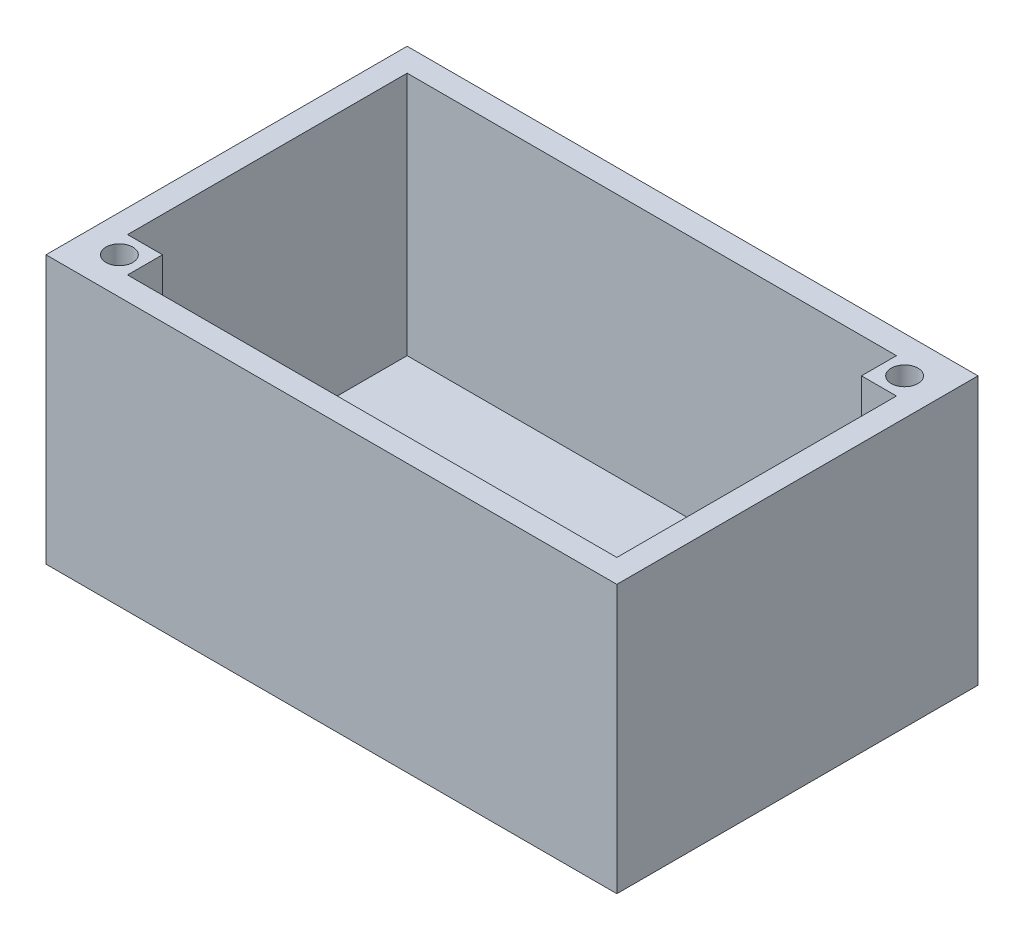
ISO-10303-21;
HEADER;
FILE_DESCRIPTION(('STEP AP214'),'2;1');
FILE_NAME('part.step','',(''),(''),'','','');
FILE_SCHEMA(('AUTOMOTIVE_DESIGN { 1 0 10303 214 1 1 1 1 }'));
ENDSEC;
DATA;
#1=APPLICATION_CONTEXT('core data for automotive mechanical design processes');
#2=APPLICATION_PROTOCOL_DEFINITION('international standard','automotive_design',2000,#1);
#3=PRODUCT_CONTEXT('',#1,'mechanical');
#4=PRODUCT('Part','Part','',(#3));
#5=PRODUCT_RELATED_PRODUCT_CATEGORY('part','',(#4));
#6=PRODUCT_DEFINITION_FORMATION('','',#4);
#7=PRODUCT_DEFINITION_CONTEXT('part definition',#1,'design');
#8=PRODUCT_DEFINITION('design','',#6,#7);
#9=PRODUCT_DEFINITION_SHAPE('','',#8);
#10=(LENGTH_UNIT() NAMED_UNIT(*) SI_UNIT(.MILLI.,.METRE.));
#11=(NAMED_UNIT(*) PLANE_ANGLE_UNIT() SI_UNIT($,.RADIAN.));
#12=(NAMED_UNIT(*) SI_UNIT($,.STERADIAN.) SOLID_ANGLE_UNIT());
#13=UNCERTAINTY_MEASURE_WITH_UNIT(LENGTH_MEASURE(1.E-05),#10,'distance_accuracy_value','');
#14=(GEOMETRIC_REPRESENTATION_CONTEXT(3) GLOBAL_UNCERTAINTY_ASSIGNED_CONTEXT((#13)) GLOBAL_UNIT_ASSIGNED_CONTEXT((#10,
#11,#12)) REPRESENTATION_CONTEXT('',''));
#15=CARTESIAN_POINT('',(0.,0.,0.));
#16=DIRECTION('',(0.,0.,1.));
#17=DIRECTION('',(1.,0.,0.));
#18=AXIS2_PLACEMENT_3D('',#15,#16,#17);
#19=CARTESIAN_POINT('',(0.,2.54,-39.37));
#20=DIRECTION('',(0.,-1.,0.));
#21=DIRECTION('',(0.,0.,-1.));
#22=AXIS2_PLACEMENT_3D('',#19,#20,#21);
#23=PLANE('',#22);
#24=CARTESIAN_POINT('',(4.0005,2.54,-4.0005));
#25=DIRECTION('',(0.,-1.,0.));
#26=DIRECTION('',(0.,0.,-1.));
#27=AXIS2_PLACEMENT_3D('',#24,#25,#26);
#28=CIRCLE('',#27,1.4605);
#29=CARTESIAN_POINT('',(4.0005,2.54,-5.461));
#30=VERTEX_POINT('',#29);
#31=EDGE_CURVE('E222',#30,#30,#28,.F.);
#32=ORIENTED_EDGE('',*,*,#31,.T.);
#33=EDGE_LOOP('',(#32));
#34=FACE_BOUND('',#33,.T.);
#35=ADVANCED_FACE('F85',(#34),#23,.F.);
#36=CARTESIAN_POINT('',(58.2295,2.54,-35.3695));
#37=DIRECTION('',(0.,-1.,0.));
#38=DIRECTION('',(0.,0.,-1.));
#39=AXIS2_PLACEMENT_3D('',#36,#37,#38);
#40=CIRCLE('',#39,1.46049999999999);
#41=CARTESIAN_POINT('',(58.2295,2.54,-36.83));
#42=VERTEX_POINT('',#41);
#43=EDGE_CURVE('E211',#42,#42,#40,.F.);
#44=ORIENTED_EDGE('',*,*,#43,.T.);
#45=EDGE_LOOP('',(#44));
#46=FACE_BOUND('',#45,.T.);
#47=ADVANCED_FACE('F304',(#46),#23,.F.);
#48=DIRECTION('',(0.,0.,1.));
#49=VECTOR('',#48,1.);
#50=CARTESIAN_POINT('',(2.54,2.54,-39.37));
#51=LINE('',#50,#49);
#52=CARTESIAN_POINT('',(2.54,2.54,-36.83));
#53=VERTEX_POINT('',#52);
#54=CARTESIAN_POINT('',(2.54,2.54,-6.35000000000001));
#55=VERTEX_POINT('',#54);
#56=EDGE_CURVE('E235',#53,#55,#51,.T.);
#57=ORIENTED_EDGE('',*,*,#56,.T.);
#58=DIRECTION('',(-1.,0.,0.));
#59=VECTOR('',#58,1.);
#60=CARTESIAN_POINT('',(0.,2.54,-6.35000000000001));
#61=LINE('',#60,#59);
#62=CARTESIAN_POINT('',(6.35,2.54,-6.35000000000001));
#63=VERTEX_POINT('',#62);
#64=EDGE_CURVE('E102',#63,#55,#61,.T.);
#65=ORIENTED_EDGE('',*,*,#64,.F.);
#66=DIRECTION('',(0.,0.,-1.));
#67=VECTOR('',#66,1.);
#68=CARTESIAN_POINT('',(6.35000000000001,2.54,0.));
#69=LINE('',#68,#67);
#70=CARTESIAN_POINT('',(6.35000000000001,2.54,-2.54));
#71=VERTEX_POINT('',#70);
#72=EDGE_CURVE('E181',#71,#63,#69,.T.);
#73=ORIENTED_EDGE('',*,*,#72,.F.);
#74=DIRECTION('',(1.,0.,0.));
#75=VECTOR('',#74,1.);
#76=CARTESIAN_POINT('',(0.,2.54,-2.54));
#77=LINE('',#76,#75);
#78=CARTESIAN_POINT('',(59.69,2.54,-2.54));
#79=VERTEX_POINT('',#78);
#80=EDGE_CURVE('E228',#71,#79,#77,.T.);
#81=ORIENTED_EDGE('',*,*,#80,.T.);
#82=DIRECTION('',(0.,0.,1.));
#83=VECTOR('',#82,1.);
#84=CARTESIAN_POINT('',(59.69,2.54,-39.37));
#85=LINE('',#84,#83);
#86=CARTESIAN_POINT('',(59.69,2.54,-33.02));
#87=VERTEX_POINT('',#86);
#88=EDGE_CURVE('E237',#87,#79,#85,.T.);
#89=ORIENTED_EDGE('',*,*,#88,.F.);
#90=DIRECTION('',(1.,0.,0.));
#91=VECTOR('',#90,1.);
#92=CARTESIAN_POINT('',(0.,2.54,-33.0200000000002));
#93=LINE('',#92,#91);
#94=CARTESIAN_POINT('',(55.88,2.54,-33.02));
#95=VERTEX_POINT('',#94);
#96=EDGE_CURVE('E204',#95,#87,#93,.T.);
#97=ORIENTED_EDGE('',*,*,#96,.F.);
#98=DIRECTION('',(0.,0.,1.));
#99=VECTOR('',#98,1.);
#100=CARTESIAN_POINT('',(55.88,2.54,0.));
#101=LINE('',#100,#99);
#102=CARTESIAN_POINT('',(55.88,2.54,-36.83));
#103=VERTEX_POINT('',#102);
#104=EDGE_CURVE('E203',#103,#95,#101,.T.);
#105=ORIENTED_EDGE('',*,*,#104,.F.);
#106=DIRECTION('',(1.,0.,0.));
#107=VECTOR('',#106,1.);
#108=CARTESIAN_POINT('',(0.,2.54,-36.83));
#109=LINE('',#108,#107);
#110=EDGE_CURVE('E234',#53,#103,#109,.T.);
#111=ORIENTED_EDGE('',*,*,#110,.F.);
#112=EDGE_LOOP('',(#57,#65,#73,#81,#89,#97,#105,#111));
#113=FACE_BOUND('',#112,.T.);
#114=ADVANCED_FACE('F307',(#113),#23,.F.);
#115=CARTESIAN_POINT('',(59.69,0.,-39.37));
#116=DIRECTION('',(1.,0.,0.));
#117=DIRECTION('',(0.,0.,-1.));
#118=AXIS2_PLACEMENT_3D('',#115,#116,#117);
#119=PLANE('',#118);
#120=DIRECTION('',(0.,0.,1.));
#121=VECTOR('',#120,1.);
#122=CARTESIAN_POINT('',(59.69,29.21,-39.37));
#123=LINE('',#122,#121);
#124=CARTESIAN_POINT('',(59.69,29.21,-33.02));
#125=VERTEX_POINT('',#124);
#126=CARTESIAN_POINT('',(59.69,29.21,-2.54));
#127=VERTEX_POINT('',#126);
#128=EDGE_CURVE('E245',#125,#127,#123,.T.);
#129=ORIENTED_EDGE('',*,*,#128,.F.);
#130=DIRECTION('',(0.,1.,0.));
#131=VECTOR('',#130,1.);
#132=CARTESIAN_POINT('',(59.69,-0.00199999999999853,-33.02));
#133=LINE('',#132,#131);
#134=EDGE_CURVE('E201',#87,#125,#133,.T.);
#135=ORIENTED_EDGE('',*,*,#134,.F.);
#136=ORIENTED_EDGE('',*,*,#88,.T.);
#137=DIRECTION('',(0.,1.,0.));
#138=VECTOR('',#137,1.);
#139=CARTESIAN_POINT('',(59.69,0.,-2.54));
#140=LINE('',#139,#138);
#141=EDGE_CURVE('E240',#79,#127,#140,.T.);
#142=ORIENTED_EDGE('',*,*,#141,.T.);
#143=EDGE_LOOP('',(#129,#135,#136,#142));
#144=FACE_BOUND('',#143,.T.);
#145=ADVANCED_FACE('F315',(#144),#119,.F.);
#146=CARTESIAN_POINT('',(2.54,0.,-39.37));
#147=DIRECTION('',(-1.,0.,0.));
#148=DIRECTION('',(0.,0.,1.));
#149=AXIS2_PLACEMENT_3D('',#146,#147,#148);
#150=PLANE('',#149);
#151=DIRECTION('',(0.,0.,1.));
#152=VECTOR('',#151,1.);
#153=CARTESIAN_POINT('',(2.54,29.21,-39.37));
#154=LINE('',#153,#152);
#155=CARTESIAN_POINT('',(2.54,29.21,-36.83));
#156=VERTEX_POINT('',#155);
#157=CARTESIAN_POINT('',(2.54,29.21,-6.35000000000001));
#158=VERTEX_POINT('',#157);
#159=EDGE_CURVE('E248',#156,#158,#154,.T.);
#160=ORIENTED_EDGE('',*,*,#159,.T.);
#161=DIRECTION('',(0.,1.,0.));
#162=VECTOR('',#161,1.);
#163=CARTESIAN_POINT('',(2.54,-0.00199999999999853,-6.35000000000001));
#164=LINE('',#163,#162);
#165=EDGE_CURVE('E110',#55,#158,#164,.T.);
#166=ORIENTED_EDGE('',*,*,#165,.F.);
#167=ORIENTED_EDGE('',*,*,#56,.F.);
#168=DIRECTION('',(0.,-1.,0.));
#169=VECTOR('',#168,1.);
#170=CARTESIAN_POINT('',(2.54,0.,-36.83));
#171=LINE('',#170,#169);
#172=EDGE_CURVE('E231',#156,#53,#171,.T.);
#173=ORIENTED_EDGE('',*,*,#172,.F.);
#174=EDGE_LOOP('',(#160,#166,#167,#173));
#175=FACE_BOUND('',#174,.T.);
#176=ADVANCED_FACE('F319',(#175),#150,.F.);
#177=CARTESIAN_POINT('',(0.,0.,-2.54));
#178=DIRECTION('',(0.,0.,-1.));
#179=DIRECTION('',(-1.,0.,0.));
#180=AXIS2_PLACEMENT_3D('',#177,#178,#179);
#181=PLANE('',#180);
#182=DIRECTION('',(0.,1.,0.));
#183=VECTOR('',#182,1.);
#184=CARTESIAN_POINT('',(6.35,-0.00199999999999853,-2.54));
#185=LINE('',#184,#183);
#186=CARTESIAN_POINT('',(6.35,29.21,-2.54));
#187=VERTEX_POINT('',#186);
#188=EDGE_CURVE('E189',#71,#187,#185,.T.);
#189=ORIENTED_EDGE('',*,*,#188,.T.);
#190=DIRECTION('',(-1.,0.,0.));
#191=VECTOR('',#190,1.);
#192=CARTESIAN_POINT('',(0.,29.21,-2.54));
#193=LINE('',#192,#191);
#194=EDGE_CURVE('E195',#127,#187,#193,.T.);
#195=ORIENTED_EDGE('',*,*,#194,.F.);
#196=ORIENTED_EDGE('',*,*,#141,.F.);
#197=ORIENTED_EDGE('',*,*,#80,.F.);
#198=EDGE_LOOP('',(#189,#195,#196,#197));
#199=FACE_BOUND('',#198,.T.);
#200=ADVANCED_FACE('F340',(#199),#181,.T.);
#201=CARTESIAN_POINT('',(0.,29.21,-39.37));
#202=DIRECTION('',(0.,1.,0.));
#203=DIRECTION('',(0.,0.,1.));
#204=AXIS2_PLACEMENT_3D('',#201,#202,#203);
#205=PLANE('',#204);
#206=DIRECTION('',(-1.,0.,0.));
#207=VECTOR('',#206,1.);
#208=CARTESIAN_POINT('',(0.,29.21,-6.35000000000001));
#209=LINE('',#208,#207);
#210=CARTESIAN_POINT('',(6.35,29.21,-6.35000000000001));
#211=VERTEX_POINT('',#210);
#212=EDGE_CURVE('E185',#211,#158,#209,.T.);
#213=ORIENTED_EDGE('',*,*,#212,.T.);
#214=ORIENTED_EDGE('',*,*,#159,.F.);
#215=DIRECTION('',(-1.,0.,0.));
#216=VECTOR('',#215,1.);
#217=CARTESIAN_POINT('',(0.,29.21,-36.83));
#218=LINE('',#217,#216);
#219=CARTESIAN_POINT('',(55.88,29.21,-36.83));
#220=VERTEX_POINT('',#219);
#221=EDGE_CURVE('E238',#220,#156,#218,.T.);
#222=ORIENTED_EDGE('',*,*,#221,.F.);
#223=DIRECTION('',(0.,0.,1.));
#224=VECTOR('',#223,1.);
#225=CARTESIAN_POINT('',(55.88,29.21,0.));
#226=LINE('',#225,#224);
#227=CARTESIAN_POINT('',(55.88,29.21,-33.02));
#228=VERTEX_POINT('',#227);
#229=EDGE_CURVE('E207',#220,#228,#226,.T.);
#230=ORIENTED_EDGE('',*,*,#229,.T.);
#231=DIRECTION('',(1.,0.,0.));
#232=VECTOR('',#231,1.);
#233=CARTESIAN_POINT('',(0.,29.21,-33.0200000000002));
#234=LINE('',#233,#232);
#235=EDGE_CURVE('E212',#228,#125,#234,.T.);
#236=ORIENTED_EDGE('',*,*,#235,.T.);
#237=ORIENTED_EDGE('',*,*,#128,.T.);
#238=ORIENTED_EDGE('',*,*,#194,.T.);
#239=DIRECTION('',(0.,0.,-1.));
#240=VECTOR('',#239,1.);
#241=CARTESIAN_POINT('',(6.35000000000001,29.21,0.));
#242=LINE('',#241,#240);
#243=EDGE_CURVE('E180',#187,#211,#242,.T.);
#244=ORIENTED_EDGE('',*,*,#243,.T.);
#245=EDGE_LOOP('',(#213,#214,#222,#230,#236,#237,#238,#244));
#246=FACE_BOUND('',#245,.T.);
#247=CARTESIAN_POINT('',(4.0005,29.21,-4.0005));
#248=DIRECTION('',(0.,1.,0.));
#249=DIRECTION('',(0.,0.,1.));
#250=AXIS2_PLACEMENT_3D('',#247,#248,#249);
#251=CIRCLE('',#250,1.4605);
#252=CARTESIAN_POINT('',(4.0005,29.21,-2.54));
#253=VERTEX_POINT('',#252);
#254=EDGE_CURVE('E225',#253,#253,#251,.T.);
#255=ORIENTED_EDGE('',*,*,#254,.F.);
#256=EDGE_LOOP('',(#255));
#257=FACE_BOUND('',#256,.T.);
#258=CARTESIAN_POINT('',(58.2295,29.21,-35.3695));
#259=DIRECTION('',(0.,1.,0.));
#260=DIRECTION('',(0.,0.,1.));
#261=AXIS2_PLACEMENT_3D('',#258,#259,#260);
#262=CIRCLE('',#261,1.46049999999999);
#263=CARTESIAN_POINT('',(58.2295,29.21,-33.909));
#264=VERTEX_POINT('',#263);
#265=EDGE_CURVE('E219',#264,#264,#262,.T.);
#266=ORIENTED_EDGE('',*,*,#265,.F.);
#267=EDGE_LOOP('',(#266));
#268=FACE_BOUND('',#267,.T.);
#269=DIRECTION('',(-1.,0.,0.));
#270=VECTOR('',#269,1.);
#271=CARTESIAN_POINT('',(0.,29.21,0.));
#272=LINE('',#271,#270);
#273=CARTESIAN_POINT('',(62.23,29.21,0.));
#274=VERTEX_POINT('',#273);
#275=CARTESIAN_POINT('',(0.,29.21,0.));
#276=VERTEX_POINT('',#275);
#277=EDGE_CURVE('E258',#274,#276,#272,.T.);
#278=ORIENTED_EDGE('',*,*,#277,.F.);
#279=DIRECTION('',(0.,0.,1.));
#280=VECTOR('',#279,1.);
#281=CARTESIAN_POINT('',(62.23,29.21,-39.37));
#282=LINE('',#281,#280);
#283=CARTESIAN_POINT('',(62.23,29.21,-39.37));
#284=VERTEX_POINT('',#283);
#285=EDGE_CURVE('E94',#284,#274,#282,.T.);
#286=ORIENTED_EDGE('',*,*,#285,.F.);
#287=DIRECTION('',(-1.,0.,0.));
#288=VECTOR('',#287,1.);
#289=CARTESIAN_POINT('',(0.,29.21,-39.37));
#290=LINE('',#289,#288);
#291=CARTESIAN_POINT('',(0.,29.21,-39.37));
#292=VERTEX_POINT('',#291);
#293=EDGE_CURVE('E264',#284,#292,#290,.T.);
#294=ORIENTED_EDGE('',*,*,#293,.T.);
#295=DIRECTION('',(0.,0.,1.));
#296=VECTOR('',#295,1.);
#297=CARTESIAN_POINT('',(0.,29.21,-39.37));
#298=LINE('',#297,#296);
#299=EDGE_CURVE('E12',#292,#276,#298,.T.);
#300=ORIENTED_EDGE('',*,*,#299,.T.);
#301=EDGE_LOOP('',(#278,#286,#294,#300));
#302=FACE_BOUND('',#301,.T.);
#303=ADVANCED_FACE('F192',(#246,#257,#268,#302),#205,.T.);
#304=CARTESIAN_POINT('',(0.,0.,-39.37));
#305=DIRECTION('',(-1.,0.,0.));
#306=DIRECTION('',(0.,0.,1.));
#307=AXIS2_PLACEMENT_3D('',#304,#305,#306);
#308=PLANE('',#307);
#309=DIRECTION('',(0.,-1.,0.));
#310=VECTOR('',#309,1.);
#311=CARTESIAN_POINT('',(0.,0.,0.));
#312=LINE('',#311,#310);
#313=CARTESIAN_POINT('',(0.,0.,0.));
#314=VERTEX_POINT('',#313);
#315=EDGE_CURVE('E250',#276,#314,#312,.T.);
#316=ORIENTED_EDGE('',*,*,#315,.F.);
#317=ORIENTED_EDGE('',*,*,#299,.F.);
#318=DIRECTION('',(0.,-1.,0.));
#319=VECTOR('',#318,1.);
#320=CARTESIAN_POINT('',(0.,0.,-39.37));
#321=LINE('',#320,#319);
#322=CARTESIAN_POINT('',(0.,0.,-39.37));
#323=VERTEX_POINT('',#322);
#324=EDGE_CURVE('E254',#292,#323,#321,.T.);
#325=ORIENTED_EDGE('',*,*,#324,.T.);
#326=DIRECTION('',(0.,0.,1.));
#327=VECTOR('',#326,1.);
#328=CARTESIAN_POINT('',(0.,0.,-39.37));
#329=LINE('',#328,#327);
#330=EDGE_CURVE('E89',#323,#314,#329,.T.);
#331=ORIENTED_EDGE('',*,*,#330,.T.);
#332=EDGE_LOOP('',(#316,#317,#325,#331));
#333=FACE_BOUND('',#332,.T.);
#334=ADVANCED_FACE('F87',(#333),#308,.T.);
#335=CARTESIAN_POINT('',(62.23,0.,-39.37));
#336=DIRECTION('',(1.,0.,0.));
#337=DIRECTION('',(0.,0.,-1.));
#338=AXIS2_PLACEMENT_3D('',#335,#336,#337);
#339=PLANE('',#338);
#340=DIRECTION('',(0.,1.,0.));
#341=VECTOR('',#340,1.);
#342=CARTESIAN_POINT('',(62.23,0.,0.));
#343=LINE('',#342,#341);
#344=CARTESIAN_POINT('',(62.23,0.,0.));
#345=VERTEX_POINT('',#344);
#346=EDGE_CURVE('E272',#345,#274,#343,.T.);
#347=ORIENTED_EDGE('',*,*,#346,.F.);
#348=DIRECTION('',(0.,0.,1.));
#349=VECTOR('',#348,1.);
#350=CARTESIAN_POINT('',(62.23,0.,-39.37));
#351=LINE('',#350,#349);
#352=CARTESIAN_POINT('',(62.23,0.,-39.37));
#353=VERTEX_POINT('',#352);
#354=EDGE_CURVE('E277',#353,#345,#351,.T.);
#355=ORIENTED_EDGE('',*,*,#354,.F.);
#356=DIRECTION('',(0.,1.,0.));
#357=VECTOR('',#356,1.);
#358=CARTESIAN_POINT('',(62.23,0.,-39.37));
#359=LINE('',#358,#357);
#360=EDGE_CURVE('E261',#353,#284,#359,.T.);
#361=ORIENTED_EDGE('',*,*,#360,.T.);
#362=ORIENTED_EDGE('',*,*,#285,.T.);
#363=EDGE_LOOP('',(#347,#355,#361,#362));
#364=FACE_BOUND('',#363,.T.);
#365=ADVANCED_FACE('F295',(#364),#339,.T.);
#366=CARTESIAN_POINT('',(0.,0.,-39.37));
#367=DIRECTION('',(0.,-1.,0.));
#368=DIRECTION('',(0.,0.,-1.));
#369=AXIS2_PLACEMENT_3D('',#366,#367,#368);
#370=PLANE('',#369);
#371=DIRECTION('',(1.,0.,0.));
#372=VECTOR('',#371,1.);
#373=CARTESIAN_POINT('',(0.,0.,0.));
#374=LINE('',#373,#372);
#375=EDGE_CURVE('E269',#314,#345,#374,.T.);
#376=ORIENTED_EDGE('',*,*,#375,.F.);
#377=ORIENTED_EDGE('',*,*,#330,.F.);
#378=DIRECTION('',(1.,0.,0.));
#379=VECTOR('',#378,1.);
#380=CARTESIAN_POINT('',(0.,0.,-39.37));
#381=LINE('',#380,#379);
#382=EDGE_CURVE('E257',#323,#353,#381,.T.);
#383=ORIENTED_EDGE('',*,*,#382,.T.);
#384=ORIENTED_EDGE('',*,*,#354,.T.);
#385=EDGE_LOOP('',(#376,#377,#383,#384));
#386=FACE_BOUND('',#385,.T.);
#387=ADVANCED_FACE('F285',(#386),#370,.T.);
#388=CARTESIAN_POINT('',(0.,0.,-39.37));
#389=DIRECTION('',(0.,0.,-1.));
#390=DIRECTION('',(-1.,0.,0.));
#391=AXIS2_PLACEMENT_3D('',#388,#389,#390);
#392=PLANE('',#391);
#393=ORIENTED_EDGE('',*,*,#324,.F.);
#394=ORIENTED_EDGE('',*,*,#293,.F.);
#395=ORIENTED_EDGE('',*,*,#360,.F.);
#396=ORIENTED_EDGE('',*,*,#382,.F.);
#397=EDGE_LOOP('',(#393,#394,#395,#396));
#398=FACE_BOUND('',#397,.T.);
#399=ADVANCED_FACE('F292',(#398),#392,.T.);
#400=CARTESIAN_POINT('',(0.,0.,0.));
#401=DIRECTION('',(0.,0.,-1.));
#402=DIRECTION('',(-1.,0.,0.));
#403=AXIS2_PLACEMENT_3D('',#400,#401,#402);
#404=PLANE('',#403);
#405=ORIENTED_EDGE('',*,*,#315,.T.);
#406=ORIENTED_EDGE('',*,*,#375,.T.);
#407=ORIENTED_EDGE('',*,*,#346,.T.);
#408=ORIENTED_EDGE('',*,*,#277,.T.);
#409=EDGE_LOOP('',(#405,#406,#407,#408));
#410=FACE_BOUND('',#409,.T.);
#411=ADVANCED_FACE('F287',(#410),#404,.F.);
#412=CARTESIAN_POINT('',(0.,0.,-36.83));
#413=DIRECTION('',(0.,0.,-1.));
#414=DIRECTION('',(-1.,0.,0.));
#415=AXIS2_PLACEMENT_3D('',#412,#413,#414);
#416=PLANE('',#415);
#417=ORIENTED_EDGE('',*,*,#110,.T.);
#418=DIRECTION('',(0.,1.,0.));
#419=VECTOR('',#418,1.);
#420=CARTESIAN_POINT('',(55.88,-0.00199999999999853,-36.83));
#421=LINE('',#420,#419);
#422=EDGE_CURVE('E208',#103,#220,#421,.T.);
#423=ORIENTED_EDGE('',*,*,#422,.T.);
#424=ORIENTED_EDGE('',*,*,#221,.T.);
#425=ORIENTED_EDGE('',*,*,#172,.T.);
#426=EDGE_LOOP('',(#417,#423,#424,#425));
#427=FACE_BOUND('',#426,.T.);
#428=ADVANCED_FACE('F326',(#427),#416,.F.);
#429=CARTESIAN_POINT('',(4.0005,-0.00199999999999853,-4.0005));
#430=DIRECTION('',(0.,1.,0.));
#431=DIRECTION('',(0.,0.,1.));
#432=AXIS2_PLACEMENT_3D('',#429,#430,#431);
#433=CYLINDRICAL_SURFACE('',#432,1.4605);
#434=ORIENTED_EDGE('',*,*,#254,.T.);
#435=EDGE_LOOP('',(#434));
#436=FACE_BOUND('',#435,.T.);
#437=ORIENTED_EDGE('',*,*,#31,.F.);
#438=EDGE_LOOP('',(#437));
#439=FACE_BOUND('',#438,.T.);
#440=ADVANCED_FACE('F355',(#436,#439),#433,.F.);
#441=CARTESIAN_POINT('',(58.2295,-0.00199999999999853,-35.3695));
#442=DIRECTION('',(0.,1.,0.));
#443=DIRECTION('',(0.,0.,1.));
#444=AXIS2_PLACEMENT_3D('',#441,#442,#443);
#445=CYLINDRICAL_SURFACE('',#444,1.46049999999999);
#446=ORIENTED_EDGE('',*,*,#265,.T.);
#447=EDGE_LOOP('',(#446));
#448=FACE_BOUND('',#447,.T.);
#449=ORIENTED_EDGE('',*,*,#43,.F.);
#450=EDGE_LOOP('',(#449));
#451=FACE_BOUND('',#450,.T.);
#452=ADVANCED_FACE('F359',(#448,#451),#445,.F.);
#453=CARTESIAN_POINT('',(0.,-0.00199999999999853,-33.0200000000002));
#454=DIRECTION('',(0.,0.,1.));
#455=DIRECTION('',(1.,0.,0.));
#456=AXIS2_PLACEMENT_3D('',#453,#454,#455);
#457=PLANE('',#456);
#458=DIRECTION('',(0.,1.,0.));
#459=VECTOR('',#458,1.);
#460=CARTESIAN_POINT('',(55.88,-0.00199999999999853,-33.02));
#461=LINE('',#460,#459);
#462=EDGE_CURVE('E205',#95,#228,#461,.T.);
#463=ORIENTED_EDGE('',*,*,#462,.F.);
#464=ORIENTED_EDGE('',*,*,#96,.T.);
#465=ORIENTED_EDGE('',*,*,#134,.T.);
#466=ORIENTED_EDGE('',*,*,#235,.F.);
#467=EDGE_LOOP('',(#463,#464,#465,#466));
#468=FACE_BOUND('',#467,.T.);
#469=ADVANCED_FACE('F334',(#468),#457,.T.);
#470=CARTESIAN_POINT('',(55.88,-0.00199999999999853,0.));
#471=DIRECTION('',(-1.,0.,0.));
#472=DIRECTION('',(0.,0.,1.));
#473=AXIS2_PLACEMENT_3D('',#470,#471,#472);
#474=PLANE('',#473);
#475=ORIENTED_EDGE('',*,*,#422,.F.);
#476=ORIENTED_EDGE('',*,*,#104,.T.);
#477=ORIENTED_EDGE('',*,*,#462,.T.);
#478=ORIENTED_EDGE('',*,*,#229,.F.);
#479=EDGE_LOOP('',(#475,#476,#477,#478));
#480=FACE_BOUND('',#479,.T.);
#481=ADVANCED_FACE('F328',(#480),#474,.T.);
#482=CARTESIAN_POINT('',(0.,-0.00199999999999853,-6.35000000000001));
#483=DIRECTION('',(0.,0.,-1.));
#484=DIRECTION('',(-1.,0.,0.));
#485=AXIS2_PLACEMENT_3D('',#482,#483,#484);
#486=PLANE('',#485);
#487=DIRECTION('',(0.,1.,0.));
#488=VECTOR('',#487,1.);
#489=CARTESIAN_POINT('',(6.35,-0.00199999999999853,-6.35000000000001));
#490=LINE('',#489,#488);
#491=EDGE_CURVE('E175',#63,#211,#490,.T.);
#492=ORIENTED_EDGE('',*,*,#491,.F.);
#493=ORIENTED_EDGE('',*,*,#64,.T.);
#494=ORIENTED_EDGE('',*,*,#165,.T.);
#495=ORIENTED_EDGE('',*,*,#212,.F.);
#496=EDGE_LOOP('',(#492,#493,#494,#495));
#497=FACE_BOUND('',#496,.T.);
#498=ADVANCED_FACE('F186',(#497),#486,.T.);
#499=CARTESIAN_POINT('',(6.35000000000001,-0.00199999999999853,0.));
#500=DIRECTION('',(1.,0.,0.));
#501=DIRECTION('',(0.,0.,-1.));
#502=AXIS2_PLACEMENT_3D('',#499,#500,#501);
#503=PLANE('',#502);
#504=ORIENTED_EDGE('',*,*,#188,.F.);
#505=ORIENTED_EDGE('',*,*,#72,.T.);
#506=ORIENTED_EDGE('',*,*,#491,.T.);
#507=ORIENTED_EDGE('',*,*,#243,.F.);
#508=EDGE_LOOP('',(#504,#505,#506,#507));
#509=FACE_BOUND('',#508,.T.);
#510=ADVANCED_FACE('F178',(#509),#503,.T.);
#511=CLOSED_SHELL('',(#35,#47,#114,#145,#176,#200,#303,#334,#365,#387,#399,#411,#428,#440,#452,
#469,#481,#498,#510));
#512=MANIFOLD_SOLID_BREP('B2',#511);
#513=ADVANCED_BREP_SHAPE_REPRESENTATION('',(#18,#512),#14);
#514=SHAPE_DEFINITION_REPRESENTATION(#9,#513);
ENDSEC;
END-ISO-10303-21;
